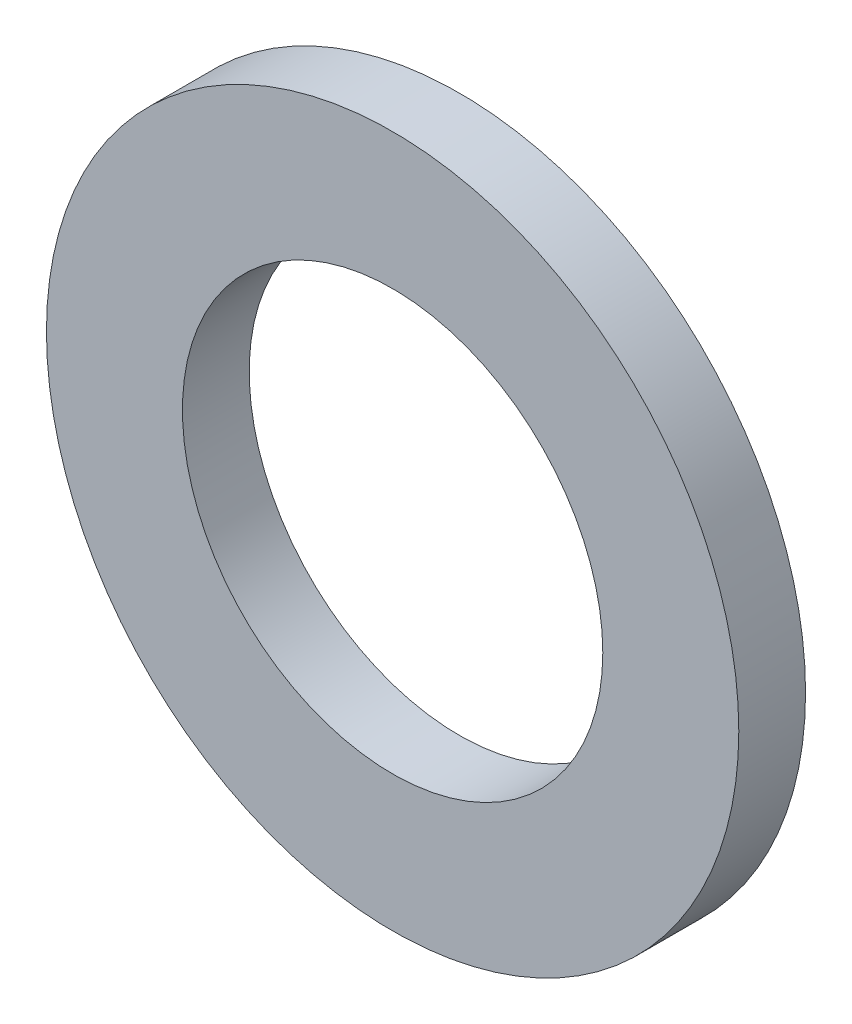
ISO-10303-21;
HEADER;
FILE_DESCRIPTION(('STEP AP214'),'2;1');
FILE_NAME('part.step','',(''),(''),'','','');
FILE_SCHEMA(('AUTOMOTIVE_DESIGN { 1 0 10303 214 1 1 1 1 }'));
ENDSEC;
DATA;
#1=APPLICATION_CONTEXT('core data for automotive mechanical design processes');
#2=APPLICATION_PROTOCOL_DEFINITION('international standard','automotive_design',2000,#1);
#3=PRODUCT_CONTEXT('',#1,'mechanical');
#4=PRODUCT('Part','Part','',(#3));
#5=PRODUCT_RELATED_PRODUCT_CATEGORY('part','',(#4));
#6=PRODUCT_DEFINITION_FORMATION('','',#4);
#7=PRODUCT_DEFINITION_CONTEXT('part definition',#1,'design');
#8=PRODUCT_DEFINITION('design','',#6,#7);
#9=PRODUCT_DEFINITION_SHAPE('','',#8);
#10=(LENGTH_UNIT() NAMED_UNIT(*) SI_UNIT(.MILLI.,.METRE.));
#11=(NAMED_UNIT(*) PLANE_ANGLE_UNIT() SI_UNIT($,.RADIAN.));
#12=(NAMED_UNIT(*) SI_UNIT($,.STERADIAN.) SOLID_ANGLE_UNIT());
#13=UNCERTAINTY_MEASURE_WITH_UNIT(LENGTH_MEASURE(1.E-05),#10,'distance_accuracy_value','');
#14=(GEOMETRIC_REPRESENTATION_CONTEXT(3) GLOBAL_UNCERTAINTY_ASSIGNED_CONTEXT((#13)) GLOBAL_UNIT_ASSIGNED_CONTEXT((#10,
#11,#12)) REPRESENTATION_CONTEXT('',''));
#15=CARTESIAN_POINT('',(0.,0.,0.));
#16=DIRECTION('',(0.,0.,1.));
#17=DIRECTION('',(1.,0.,0.));
#18=AXIS2_PLACEMENT_3D('',#15,#16,#17);
#19=CARTESIAN_POINT('',(0.,0.,2.7));
#20=DIRECTION('',(0.,0.,1.));
#21=DIRECTION('',(1.,0.,0.));
#22=AXIS2_PLACEMENT_3D('',#19,#20,#21);
#23=PLANE('',#22);
#24=CARTESIAN_POINT('',(0.,0.,2.7));
#25=DIRECTION('',(0.,0.,1.));
#26=DIRECTION('',(1.,0.,0.));
#27=AXIS2_PLACEMENT_3D('',#24,#25,#26);
#28=CIRCLE('',#27,14.);
#29=CARTESIAN_POINT('',(14.,0.,2.7));
#30=VERTEX_POINT('',#29);
#31=EDGE_CURVE('E10',#30,#30,#28,.T.);
#32=ORIENTED_EDGE('',*,*,#31,.T.);
#33=EDGE_LOOP('',(#32));
#34=FACE_BOUND('',#33,.T.);
#35=CARTESIAN_POINT('',(0.,0.,2.7));
#36=DIRECTION('',(0.,0.,1.));
#37=DIRECTION('',(1.,0.,0.));
#38=AXIS2_PLACEMENT_3D('',#35,#36,#37);
#39=CIRCLE('',#38,8.5);
#40=CARTESIAN_POINT('',(8.5,0.,2.7));
#41=VERTEX_POINT('',#40);
#42=EDGE_CURVE('E41',#41,#41,#39,.T.);
#43=ORIENTED_EDGE('',*,*,#42,.F.);
#44=EDGE_LOOP('',(#43));
#45=FACE_BOUND('',#44,.T.);
#46=ADVANCED_FACE('F30',(#34,#45),#23,.T.);
#47=CARTESIAN_POINT('',(0.,0.,0.));
#48=DIRECTION('',(0.,0.,1.));
#49=DIRECTION('',(1.,0.,0.));
#50=AXIS2_PLACEMENT_3D('',#47,#48,#49);
#51=PLANE('',#50);
#52=CARTESIAN_POINT('',(0.,0.,0.));
#53=DIRECTION('',(0.,0.,1.));
#54=DIRECTION('',(1.,0.,0.));
#55=AXIS2_PLACEMENT_3D('',#52,#53,#54);
#56=CIRCLE('',#55,14.);
#57=CARTESIAN_POINT('',(14.,0.,0.));
#58=VERTEX_POINT('',#57);
#59=EDGE_CURVE('E34',#58,#58,#56,.T.);
#60=ORIENTED_EDGE('',*,*,#59,.F.);
#61=EDGE_LOOP('',(#60));
#62=FACE_BOUND('',#61,.T.);
#63=CARTESIAN_POINT('',(0.,0.,0.));
#64=DIRECTION('',(0.,0.,1.));
#65=DIRECTION('',(1.,0.,0.));
#66=AXIS2_PLACEMENT_3D('',#63,#64,#65);
#67=CIRCLE('',#66,8.5);
#68=CARTESIAN_POINT('',(8.5,0.,0.));
#69=VERTEX_POINT('',#68);
#70=EDGE_CURVE('E43',#69,#69,#67,.T.);
#71=ORIENTED_EDGE('',*,*,#70,.T.);
#72=EDGE_LOOP('',(#71));
#73=FACE_BOUND('',#72,.T.);
#74=ADVANCED_FACE('F53',(#62,#73),#51,.F.);
#75=CARTESIAN_POINT('',(0.,0.,2.7));
#76=DIRECTION('',(0.,0.,-1.));
#77=DIRECTION('',(-1.,0.,0.));
#78=AXIS2_PLACEMENT_3D('',#75,#76,#77);
#79=CYLINDRICAL_SURFACE('',#78,14.);
#80=ORIENTED_EDGE('',*,*,#31,.F.);
#81=EDGE_LOOP('',(#80));
#82=FACE_BOUND('',#81,.T.);
#83=ORIENTED_EDGE('',*,*,#59,.T.);
#84=EDGE_LOOP('',(#83));
#85=FACE_BOUND('',#84,.T.);
#86=ADVANCED_FACE('F32',(#82,#85),#79,.T.);
#87=CARTESIAN_POINT('',(0.,0.,2.7));
#88=DIRECTION('',(0.,0.,-1.));
#89=DIRECTION('',(-1.,0.,0.));
#90=AXIS2_PLACEMENT_3D('',#87,#88,#89);
#91=CYLINDRICAL_SURFACE('',#90,8.5);
#92=ORIENTED_EDGE('',*,*,#42,.T.);
#93=EDGE_LOOP('',(#92));
#94=FACE_BOUND('',#93,.T.);
#95=ORIENTED_EDGE('',*,*,#70,.F.);
#96=EDGE_LOOP('',(#95));
#97=FACE_BOUND('',#96,.T.);
#98=ADVANCED_FACE('F49',(#94,#97),#91,.F.);
#99=CLOSED_SHELL('',(#46,#74,#86,#98));
#100=MANIFOLD_SOLID_BREP('B2',#99);
#101=ADVANCED_BREP_SHAPE_REPRESENTATION('',(#18,#100),#14);
#102=SHAPE_DEFINITION_REPRESENTATION(#9,#101);
ENDSEC;
END-ISO-10303-21;
